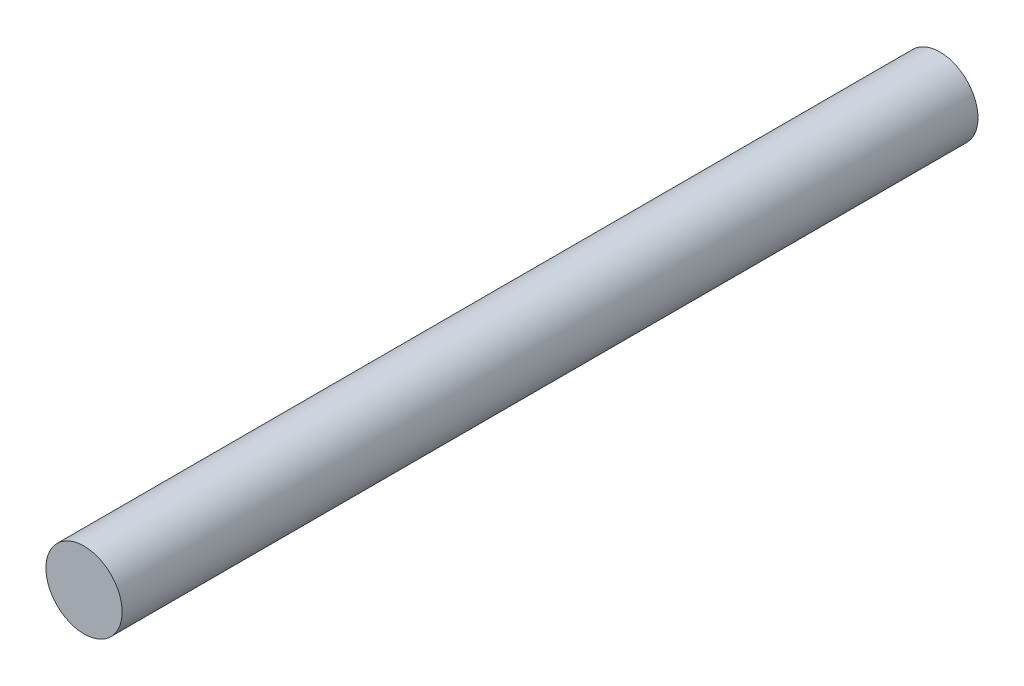
ISO-10303-21;
HEADER;
FILE_DESCRIPTION(('STEP AP214'),'2;1');
FILE_NAME('part.step','',(''),(''),'','','');
FILE_SCHEMA(('AUTOMOTIVE_DESIGN { 1 0 10303 214 1 1 1 1 }'));
ENDSEC;
DATA;
#1=APPLICATION_CONTEXT('core data for automotive mechanical design processes');
#2=APPLICATION_PROTOCOL_DEFINITION('international standard','automotive_design',2000,#1);
#3=PRODUCT_CONTEXT('',#1,'mechanical');
#4=PRODUCT('Part','Part','',(#3));
#5=PRODUCT_RELATED_PRODUCT_CATEGORY('part','',(#4));
#6=PRODUCT_DEFINITION_FORMATION('','',#4);
#7=PRODUCT_DEFINITION_CONTEXT('part definition',#1,'design');
#8=PRODUCT_DEFINITION('design','',#6,#7);
#9=PRODUCT_DEFINITION_SHAPE('','',#8);
#10=(LENGTH_UNIT() NAMED_UNIT(*) SI_UNIT(.MILLI.,.METRE.));
#11=(NAMED_UNIT(*) PLANE_ANGLE_UNIT() SI_UNIT($,.RADIAN.));
#12=(NAMED_UNIT(*) SI_UNIT($,.STERADIAN.) SOLID_ANGLE_UNIT());
#13=UNCERTAINTY_MEASURE_WITH_UNIT(LENGTH_MEASURE(1.E-05),#10,'distance_accuracy_value','');
#14=(GEOMETRIC_REPRESENTATION_CONTEXT(3) GLOBAL_UNCERTAINTY_ASSIGNED_CONTEXT((#13)) GLOBAL_UNIT_ASSIGNED_CONTEXT((#10,
#11,#12)) REPRESENTATION_CONTEXT('',''));
#15=CARTESIAN_POINT('',(0.,0.,0.));
#16=DIRECTION('',(0.,0.,1.));
#17=DIRECTION('',(1.,0.,0.));
#18=AXIS2_PLACEMENT_3D('',#15,#16,#17);
#19=CARTESIAN_POINT('',(0.,0.,107.));
#20=DIRECTION('',(0.,0.,-1.));
#21=DIRECTION('',(-1.,0.,0.));
#22=AXIS2_PLACEMENT_3D('',#19,#20,#21);
#23=CYLINDRICAL_SURFACE('',#22,4.7625);
#24=CARTESIAN_POINT('',(0.,0.,107.));
#25=DIRECTION('',(0.,0.,1.));
#26=DIRECTION('',(1.,0.,0.));
#27=AXIS2_PLACEMENT_3D('',#24,#25,#26);
#28=CIRCLE('',#27,4.7625);
#29=CARTESIAN_POINT('',(4.7625,0.,107.));
#30=VERTEX_POINT('',#29);
#31=EDGE_CURVE('E12',#30,#30,#28,.T.);
#32=ORIENTED_EDGE('',*,*,#31,.F.);
#33=EDGE_LOOP('',(#32));
#34=FACE_BOUND('',#33,.T.);
#35=CARTESIAN_POINT('',(0.,0.,0.));
#36=DIRECTION('',(0.,0.,1.));
#37=DIRECTION('',(1.,0.,0.));
#38=AXIS2_PLACEMENT_3D('',#35,#36,#37);
#39=CIRCLE('',#38,4.7625);
#40=CARTESIAN_POINT('',(4.7625,0.,0.));
#41=VERTEX_POINT('',#40);
#42=EDGE_CURVE('E43',#41,#41,#39,.T.);
#43=ORIENTED_EDGE('',*,*,#42,.T.);
#44=EDGE_LOOP('',(#43));
#45=FACE_BOUND('',#44,.T.);
#46=ADVANCED_FACE('F40',(#34,#45),#23,.T.);
#47=CARTESIAN_POINT('',(0.,0.,107.));
#48=DIRECTION('',(0.,0.,1.));
#49=DIRECTION('',(1.,0.,0.));
#50=AXIS2_PLACEMENT_3D('',#47,#48,#49);
#51=PLANE('',#50);
#52=ORIENTED_EDGE('',*,*,#31,.T.);
#53=EDGE_LOOP('',(#52));
#54=FACE_BOUND('',#53,.T.);
#55=ADVANCED_FACE('F55',(#54),#51,.T.);
#56=CARTESIAN_POINT('',(0.,0.,0.));
#57=DIRECTION('',(0.,0.,1.));
#58=DIRECTION('',(1.,0.,0.));
#59=AXIS2_PLACEMENT_3D('',#56,#57,#58);
#60=PLANE('',#59);
#61=ORIENTED_EDGE('',*,*,#42,.F.);
#62=EDGE_LOOP('',(#61));
#63=FACE_BOUND('',#62,.T.);
#64=ADVANCED_FACE('F53',(#63),#60,.F.);
#65=CLOSED_SHELL('',(#46,#55,#64));
#66=MANIFOLD_SOLID_BREP('B2',#65);
#67=ADVANCED_BREP_SHAPE_REPRESENTATION('',(#18,#66),#14);
#68=SHAPE_DEFINITION_REPRESENTATION(#9,#67);
ENDSEC;
END-ISO-10303-21;
